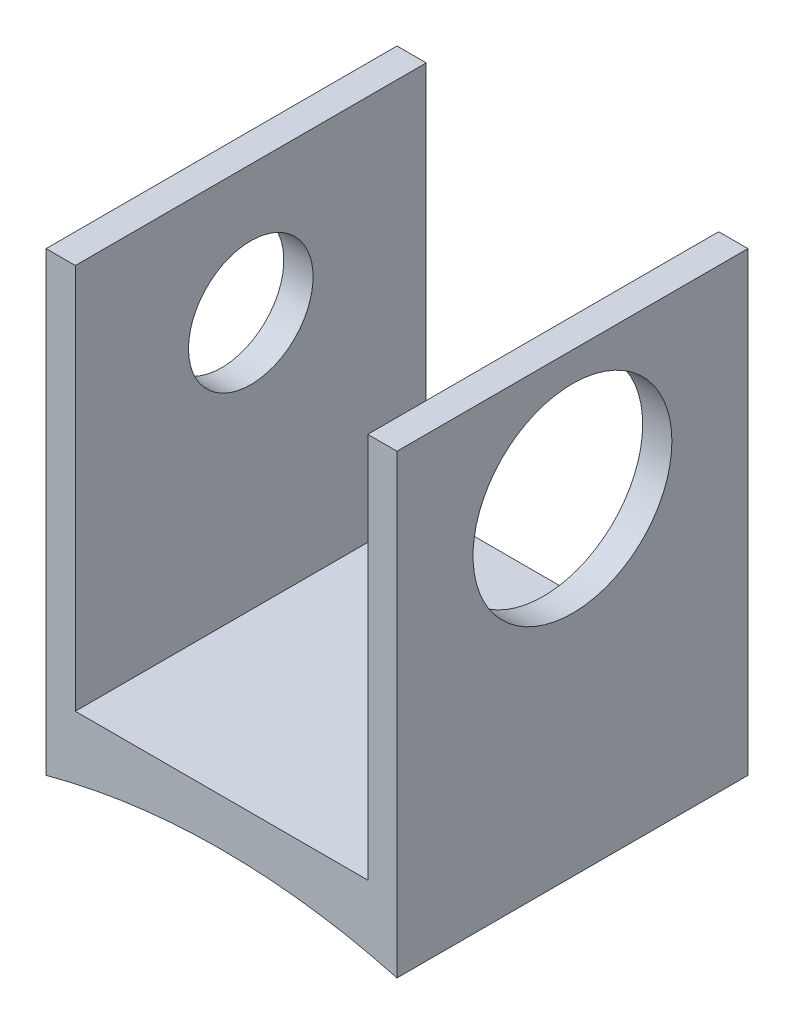
ISO-10303-21;
HEADER;
FILE_DESCRIPTION(('STEP AP214'),'2;1');
FILE_NAME('part.step','',(''),(''),'','','');
FILE_SCHEMA(('AUTOMOTIVE_DESIGN { 1 0 10303 214 1 1 1 1 }'));
ENDSEC;
DATA;
#1=APPLICATION_CONTEXT('core data for automotive mechanical design processes');
#2=APPLICATION_PROTOCOL_DEFINITION('international standard','automotive_design',2000,#1);
#3=PRODUCT_CONTEXT('',#1,'mechanical');
#4=PRODUCT('Part','Part','',(#3));
#5=PRODUCT_RELATED_PRODUCT_CATEGORY('part','',(#4));
#6=PRODUCT_DEFINITION_FORMATION('','',#4);
#7=PRODUCT_DEFINITION_CONTEXT('part definition',#1,'design');
#8=PRODUCT_DEFINITION('design','',#6,#7);
#9=PRODUCT_DEFINITION_SHAPE('','',#8);
#10=(LENGTH_UNIT() NAMED_UNIT(*) SI_UNIT(.MILLI.,.METRE.));
#11=(NAMED_UNIT(*) PLANE_ANGLE_UNIT() SI_UNIT($,.RADIAN.));
#12=(NAMED_UNIT(*) SI_UNIT($,.STERADIAN.) SOLID_ANGLE_UNIT());
#13=UNCERTAINTY_MEASURE_WITH_UNIT(LENGTH_MEASURE(1.E-05),#10,'distance_accuracy_value','');
#14=(GEOMETRIC_REPRESENTATION_CONTEXT(3) GLOBAL_UNCERTAINTY_ASSIGNED_CONTEXT((#13)) GLOBAL_UNIT_ASSIGNED_CONTEXT((#10,
#11,#12)) REPRESENTATION_CONTEXT('',''));
#15=CARTESIAN_POINT('',(0.,0.,0.));
#16=DIRECTION('',(0.,0.,1.));
#17=DIRECTION('',(1.,0.,0.));
#18=AXIS2_PLACEMENT_3D('',#15,#16,#17);
#19=CARTESIAN_POINT('',(-2.71887323943662,7.61418661971831,7.62));
#20=DIRECTION('',(0.,-1.,0.));
#21=DIRECTION('',(0.,0.,-1.));
#22=AXIS2_PLACEMENT_3D('',#19,#20,#21);
#23=PLANE('',#22);
#24=DIRECTION('',(-1.,0.,0.));
#25=VECTOR('',#24,1.);
#26=CARTESIAN_POINT('',(-2.71887323943662,7.61418661971831,0.));
#27=LINE('',#26,#25);
#28=CARTESIAN_POINT('',(-2.71887323943662,7.61418661971831,0.));
#29=VERTEX_POINT('',#28);
#30=CARTESIAN_POINT('',(-3.35387323943662,7.61418661971831,0.));
#31=VERTEX_POINT('',#30);
#32=EDGE_CURVE('E129',#29,#31,#27,.T.);
#33=ORIENTED_EDGE('',*,*,#32,.T.);
#34=DIRECTION('',(0.,0.,-1.));
#35=VECTOR('',#34,1.);
#36=CARTESIAN_POINT('',(-3.35387323943662,7.61418661971831,7.62));
#37=LINE('',#36,#35);
#38=CARTESIAN_POINT('',(-3.35387323943662,7.61418661971831,7.62));
#39=VERTEX_POINT('',#38);
#40=EDGE_CURVE('E11',#39,#31,#37,.T.);
#41=ORIENTED_EDGE('',*,*,#40,.F.);
#42=DIRECTION('',(-1.,0.,0.));
#43=VECTOR('',#42,1.);
#44=CARTESIAN_POINT('',(-2.71887323943662,7.61418661971831,7.62));
#45=LINE('',#44,#43);
#46=CARTESIAN_POINT('',(-2.71887323943662,7.61418661971831,7.62));
#47=VERTEX_POINT('',#46);
#48=EDGE_CURVE('E143',#47,#39,#45,.T.);
#49=ORIENTED_EDGE('',*,*,#48,.F.);
#50=DIRECTION('',(0.,0.,-1.));
#51=VECTOR('',#50,1.);
#52=CARTESIAN_POINT('',(-2.71887323943662,7.61418661971831,7.62));
#53=LINE('',#52,#51);
#54=EDGE_CURVE('E125',#47,#29,#53,.T.);
#55=ORIENTED_EDGE('',*,*,#54,.T.);
#56=EDGE_LOOP('',(#33,#41,#49,#55));
#57=FACE_BOUND('',#56,.T.);
#58=ADVANCED_FACE('F36',(#57),#23,.F.);
#59=CARTESIAN_POINT('',(-3.35387323943662,7.61418661971831,7.62));
#60=DIRECTION('',(1.,0.,0.));
#61=DIRECTION('',(0.,1.,0.));
#62=AXIS2_PLACEMENT_3D('',#59,#60,#61);
#63=PLANE('',#62);
#64=CARTESIAN_POINT('',(-3.35387323943662,4.82018661971831,3.81));
#65=DIRECTION('',(-1.,0.,0.));
#66=DIRECTION('',(0.,0.,1.));
#67=AXIS2_PLACEMENT_3D('',#64,#65,#66);
#68=CIRCLE('',#67,1.35254999999999);
#69=CARTESIAN_POINT('',(-3.35387323943662,4.82018661971831,5.16254999999999));
#70=VERTEX_POINT('',#69);
#71=EDGE_CURVE('E187',#70,#70,#68,.T.);
#72=ORIENTED_EDGE('',*,*,#71,.F.);
#73=EDGE_LOOP('',(#72));
#74=FACE_BOUND('',#73,.T.);
#75=DIRECTION('',(0.,-1.,0.));
#76=VECTOR('',#75,1.);
#77=CARTESIAN_POINT('',(-3.35387323943662,7.61418661971831,0.));
#78=LINE('',#77,#76);
#79=CARTESIAN_POINT('',(-3.35387323943662,-2.29181338028169,0.));
#80=VERTEX_POINT('',#79);
#81=EDGE_CURVE('E132',#31,#80,#78,.T.);
#82=ORIENTED_EDGE('',*,*,#81,.T.);
#83=DIRECTION('',(0.,0.,-1.));
#84=VECTOR('',#83,1.);
#85=CARTESIAN_POINT('',(-3.35387323943662,-2.29181338028169,7.62));
#86=LINE('',#85,#84);
#87=CARTESIAN_POINT('',(-3.35387323943662,-2.29181338028169,7.62));
#88=VERTEX_POINT('',#87);
#89=EDGE_CURVE('E44',#88,#80,#86,.T.);
#90=ORIENTED_EDGE('',*,*,#89,.F.);
#91=DIRECTION('',(0.,-1.,0.));
#92=VECTOR('',#91,1.);
#93=CARTESIAN_POINT('',(-3.35387323943662,7.61418661971831,7.62));
#94=LINE('',#93,#92);
#95=EDGE_CURVE('E93',#39,#88,#94,.T.);
#96=ORIENTED_EDGE('',*,*,#95,.F.);
#97=ORIENTED_EDGE('',*,*,#40,.T.);
#98=EDGE_LOOP('',(#82,#90,#96,#97));
#99=FACE_BOUND('',#98,.T.);
#100=ADVANCED_FACE('F166',(#74,#99),#63,.F.);
#101=CARTESIAN_POINT('',(4.26612676056338,-2.29181338028169,7.62));
#102=DIRECTION('',(-1.,0.,0.));
#103=DIRECTION('',(0.,-1.,0.));
#104=AXIS2_PLACEMENT_3D('',#101,#102,#103);
#105=PLANE('',#104);
#106=CARTESIAN_POINT('',(4.26612676056338,4.82018661971831,3.81));
#107=DIRECTION('',(1.,0.,0.));
#108=DIRECTION('',(0.,0.,-1.));
#109=AXIS2_PLACEMENT_3D('',#106,#107,#108);
#110=CIRCLE('',#109,2.159);
#111=CARTESIAN_POINT('',(4.26612676056338,4.82018661971831,1.651));
#112=VERTEX_POINT('',#111);
#113=EDGE_CURVE('E182',#112,#112,#110,.T.);
#114=ORIENTED_EDGE('',*,*,#113,.F.);
#115=EDGE_LOOP('',(#114));
#116=FACE_BOUND('',#115,.T.);
#117=DIRECTION('',(0.,1.,0.));
#118=VECTOR('',#117,1.);
#119=CARTESIAN_POINT('',(4.26612676056338,-2.29181338028169,0.));
#120=LINE('',#119,#118);
#121=CARTESIAN_POINT('',(4.26612676056338,-2.29181338028169,0.));
#122=VERTEX_POINT('',#121);
#123=CARTESIAN_POINT('',(4.26612676056338,7.61418661971831,0.));
#124=VERTEX_POINT('',#123);
#125=EDGE_CURVE('E136',#122,#124,#120,.T.);
#126=ORIENTED_EDGE('',*,*,#125,.T.);
#127=DIRECTION('',(0.,0.,-1.));
#128=VECTOR('',#127,1.);
#129=CARTESIAN_POINT('',(4.26612676056338,7.61418661971831,7.62));
#130=LINE('',#129,#128);
#131=CARTESIAN_POINT('',(4.26612676056338,7.61418661971831,7.62));
#132=VERTEX_POINT('',#131);
#133=EDGE_CURVE('E147',#132,#124,#130,.T.);
#134=ORIENTED_EDGE('',*,*,#133,.F.);
#135=DIRECTION('',(0.,1.,0.));
#136=VECTOR('',#135,1.);
#137=CARTESIAN_POINT('',(4.26612676056338,-2.29181338028169,7.62));
#138=LINE('',#137,#136);
#139=CARTESIAN_POINT('',(4.26612676056338,-2.29181338028169,7.62));
#140=VERTEX_POINT('',#139);
#141=EDGE_CURVE('E177',#140,#132,#138,.T.);
#142=ORIENTED_EDGE('',*,*,#141,.F.);
#143=DIRECTION('',(0.,0.,-1.));
#144=VECTOR('',#143,1.);
#145=CARTESIAN_POINT('',(4.26612676056338,-2.29181338028169,7.62));
#146=LINE('',#145,#144);
#147=EDGE_CURVE('E150',#140,#122,#146,.T.);
#148=ORIENTED_EDGE('',*,*,#147,.T.);
#149=EDGE_LOOP('',(#126,#134,#142,#148));
#150=FACE_BOUND('',#149,.T.);
#151=ADVANCED_FACE('F175',(#116,#150),#105,.F.);
#152=CARTESIAN_POINT('',(3.63112676056338,7.61418661971831,7.62));
#153=DIRECTION('',(0.,-1.,0.));
#154=DIRECTION('',(0.,0.,-1.));
#155=AXIS2_PLACEMENT_3D('',#152,#153,#154);
#156=PLANE('',#155);
#157=DIRECTION('',(-1.,0.,0.));
#158=VECTOR('',#157,1.);
#159=CARTESIAN_POINT('',(3.63112676056338,7.61418661971831,0.));
#160=LINE('',#159,#158);
#161=CARTESIAN_POINT('',(3.63112676056338,7.61418661971831,0.));
#162=VERTEX_POINT('',#161);
#163=EDGE_CURVE('E138',#124,#162,#160,.T.);
#164=ORIENTED_EDGE('',*,*,#163,.T.);
#165=DIRECTION('',(0.,0.,-1.));
#166=VECTOR('',#165,1.);
#167=CARTESIAN_POINT('',(3.63112676056338,7.61418661971831,7.62));
#168=LINE('',#167,#166);
#169=CARTESIAN_POINT('',(3.63112676056338,7.61418661971831,7.62));
#170=VERTEX_POINT('',#169);
#171=EDGE_CURVE('E120',#170,#162,#168,.T.);
#172=ORIENTED_EDGE('',*,*,#171,.F.);
#173=DIRECTION('',(-1.,0.,0.));
#174=VECTOR('',#173,1.);
#175=CARTESIAN_POINT('',(3.63112676056338,7.61418661971831,7.62));
#176=LINE('',#175,#174);
#177=EDGE_CURVE('E111',#132,#170,#176,.T.);
#178=ORIENTED_EDGE('',*,*,#177,.F.);
#179=ORIENTED_EDGE('',*,*,#133,.T.);
#180=EDGE_LOOP('',(#164,#172,#178,#179));
#181=FACE_BOUND('',#180,.T.);
#182=ADVANCED_FACE('F171',(#181),#156,.F.);
#183=CARTESIAN_POINT('',(3.63112676056338,7.61418661971831,7.62));
#184=DIRECTION('',(1.,0.,0.));
#185=DIRECTION('',(0.,1.,0.));
#186=AXIS2_PLACEMENT_3D('',#183,#184,#185);
#187=PLANE('',#186);
#188=CARTESIAN_POINT('',(3.63112676056338,4.82018661971831,3.81));
#189=DIRECTION('',(1.,0.,0.));
#190=DIRECTION('',(0.,1.,0.));
#191=AXIS2_PLACEMENT_3D('',#188,#189,#190);
#192=CIRCLE('',#191,2.159);
#193=CARTESIAN_POINT('',(3.63112676056338,6.97918661971831,3.81));
#194=VERTEX_POINT('',#193);
#195=EDGE_CURVE('E179',#194,#194,#192,.F.);
#196=ORIENTED_EDGE('',*,*,#195,.F.);
#197=EDGE_LOOP('',(#196));
#198=FACE_BOUND('',#197,.T.);
#199=DIRECTION('',(0.,-1.,0.));
#200=VECTOR('',#199,1.);
#201=CARTESIAN_POINT('',(3.63112676056338,7.61418661971831,0.));
#202=LINE('',#201,#200);
#203=CARTESIAN_POINT('',(3.63112676056338,-0.767813380281691,0.));
#204=VERTEX_POINT('',#203);
#205=EDGE_CURVE('E119',#162,#204,#202,.T.);
#206=ORIENTED_EDGE('',*,*,#205,.T.);
#207=DIRECTION('',(0.,0.,-1.));
#208=VECTOR('',#207,1.);
#209=CARTESIAN_POINT('',(3.63112676056338,-0.767813380281691,7.62));
#210=LINE('',#209,#208);
#211=CARTESIAN_POINT('',(3.63112676056338,-0.767813380281691,7.62));
#212=VERTEX_POINT('',#211);
#213=EDGE_CURVE('E116',#212,#204,#210,.T.);
#214=ORIENTED_EDGE('',*,*,#213,.F.);
#215=DIRECTION('',(0.,-1.,0.));
#216=VECTOR('',#215,1.);
#217=CARTESIAN_POINT('',(3.63112676056338,7.61418661971831,7.62));
#218=LINE('',#217,#216);
#219=EDGE_CURVE('E104',#170,#212,#218,.T.);
#220=ORIENTED_EDGE('',*,*,#219,.F.);
#221=ORIENTED_EDGE('',*,*,#171,.T.);
#222=EDGE_LOOP('',(#206,#214,#220,#221));
#223=FACE_BOUND('',#222,.T.);
#224=ADVANCED_FACE('F117',(#198,#223),#187,.F.);
#225=CARTESIAN_POINT('',(3.63112676056338,-0.767813380281691,7.62));
#226=DIRECTION('',(0.,-1.,0.));
#227=DIRECTION('',(1.,0.,0.));
#228=AXIS2_PLACEMENT_3D('',#225,#226,#227);
#229=PLANE('',#228);
#230=DIRECTION('',(-1.,0.,0.));
#231=VECTOR('',#230,1.);
#232=CARTESIAN_POINT('',(3.63112676056338,-0.767813380281691,0.));
#233=LINE('',#232,#231);
#234=CARTESIAN_POINT('',(-2.71887323943662,-0.767813380281691,0.));
#235=VERTEX_POINT('',#234);
#236=EDGE_CURVE('E79',#204,#235,#233,.T.);
#237=ORIENTED_EDGE('',*,*,#236,.T.);
#238=DIRECTION('',(0.,0.,-1.));
#239=VECTOR('',#238,1.);
#240=CARTESIAN_POINT('',(-2.71887323943662,-0.767813380281691,7.62));
#241=LINE('',#240,#239);
#242=CARTESIAN_POINT('',(-2.71887323943662,-0.767813380281691,7.62));
#243=VERTEX_POINT('',#242);
#244=EDGE_CURVE('E121',#243,#235,#241,.T.);
#245=ORIENTED_EDGE('',*,*,#244,.F.);
#246=DIRECTION('',(-1.,0.,0.));
#247=VECTOR('',#246,1.);
#248=CARTESIAN_POINT('',(3.63112676056338,-0.767813380281691,7.62));
#249=LINE('',#248,#247);
#250=EDGE_CURVE('E109',#212,#243,#249,.T.);
#251=ORIENTED_EDGE('',*,*,#250,.F.);
#252=ORIENTED_EDGE('',*,*,#213,.T.);
#253=EDGE_LOOP('',(#237,#245,#251,#252));
#254=FACE_BOUND('',#253,.T.);
#255=ADVANCED_FACE('F123',(#254),#229,.F.);
#256=CARTESIAN_POINT('',(-2.71887323943662,-0.767813380281691,7.62));
#257=DIRECTION('',(-1.,0.,0.));
#258=DIRECTION('',(0.,0.,1.));
#259=AXIS2_PLACEMENT_3D('',#256,#257,#258);
#260=PLANE('',#259);
#261=CARTESIAN_POINT('',(-2.71887323943662,4.82018661971831,3.81));
#262=DIRECTION('',(-1.,0.,0.));
#263=DIRECTION('',(0.,0.,1.));
#264=AXIS2_PLACEMENT_3D('',#261,#262,#263);
#265=CIRCLE('',#264,1.35254999999999);
#266=CARTESIAN_POINT('',(-2.71887323943662,4.82018661971831,5.16254999999999));
#267=VERTEX_POINT('',#266);
#268=EDGE_CURVE('E133',#267,#267,#265,.T.);
#269=ORIENTED_EDGE('',*,*,#268,.T.);
#270=EDGE_LOOP('',(#269));
#271=FACE_BOUND('',#270,.T.);
#272=DIRECTION('',(0.,1.,0.));
#273=VECTOR('',#272,1.);
#274=CARTESIAN_POINT('',(-2.71887323943662,-0.767813380281691,0.));
#275=LINE('',#274,#273);
#276=EDGE_CURVE('E85',#235,#29,#275,.T.);
#277=ORIENTED_EDGE('',*,*,#276,.T.);
#278=ORIENTED_EDGE('',*,*,#54,.F.);
#279=DIRECTION('',(0.,1.,0.));
#280=VECTOR('',#279,1.);
#281=CARTESIAN_POINT('',(-2.71887323943662,-0.767813380281691,7.62));
#282=LINE('',#281,#280);
#283=EDGE_CURVE('E52',#243,#47,#282,.T.);
#284=ORIENTED_EDGE('',*,*,#283,.F.);
#285=ORIENTED_EDGE('',*,*,#244,.T.);
#286=EDGE_LOOP('',(#277,#278,#284,#285));
#287=FACE_BOUND('',#286,.T.);
#288=ADVANCED_FACE('F196',(#271,#287),#260,.F.);
#289=CARTESIAN_POINT('',(0.,0.,7.62));
#290=DIRECTION('',(0.,0.,1.));
#291=DIRECTION('',(1.,0.,0.));
#292=AXIS2_PLACEMENT_3D('',#289,#290,#291);
#293=PLANE('',#292);
#294=CARTESIAN_POINT('',(0.456126760563381,-16.2595040985071,7.62));
#295=DIRECTION('',(0.,0.,-1.));
#296=DIRECTION('',(1.,0.,0.));
#297=AXIS2_PLACEMENT_3D('',#294,#295,#296);
#298=CIRCLE('',#297,14.478);
#299=EDGE_CURVE('E159',#88,#140,#298,.T.);
#300=ORIENTED_EDGE('',*,*,#299,.T.);
#301=ORIENTED_EDGE('',*,*,#141,.T.);
#302=ORIENTED_EDGE('',*,*,#177,.T.);
#303=ORIENTED_EDGE('',*,*,#219,.T.);
#304=ORIENTED_EDGE('',*,*,#250,.T.);
#305=ORIENTED_EDGE('',*,*,#283,.T.);
#306=ORIENTED_EDGE('',*,*,#48,.T.);
#307=ORIENTED_EDGE('',*,*,#95,.T.);
#308=EDGE_LOOP('',(#300,#301,#302,#303,#304,#305,#306,#307));
#309=FACE_BOUND('',#308,.T.);
#310=ADVANCED_FACE('F107',(#309),#293,.T.);
#311=CARTESIAN_POINT('',(0.,0.,0.));
#312=DIRECTION('',(0.,0.,1.));
#313=DIRECTION('',(1.,0.,0.));
#314=AXIS2_PLACEMENT_3D('',#311,#312,#313);
#315=PLANE('',#314);
#316=ORIENTED_EDGE('',*,*,#125,.F.);
#317=CARTESIAN_POINT('',(0.456126760563381,-16.2595040985071,0.));
#318=DIRECTION('',(0.,0.,-1.));
#319=DIRECTION('',(1.,0.,0.));
#320=AXIS2_PLACEMENT_3D('',#317,#318,#319);
#321=CIRCLE('',#320,14.478);
#322=EDGE_CURVE('E158',#80,#122,#321,.T.);
#323=ORIENTED_EDGE('',*,*,#322,.F.);
#324=ORIENTED_EDGE('',*,*,#81,.F.);
#325=ORIENTED_EDGE('',*,*,#32,.F.);
#326=ORIENTED_EDGE('',*,*,#276,.F.);
#327=ORIENTED_EDGE('',*,*,#236,.F.);
#328=ORIENTED_EDGE('',*,*,#205,.F.);
#329=ORIENTED_EDGE('',*,*,#163,.F.);
#330=EDGE_LOOP('',(#316,#323,#324,#325,#326,#327,#328,#329));
#331=FACE_BOUND('',#330,.T.);
#332=ADVANCED_FACE('F162',(#331),#315,.F.);
#333=CARTESIAN_POINT('',(-3.35387323943662,4.82018661971831,3.81));
#334=DIRECTION('',(-1.,0.,0.));
#335=DIRECTION('',(0.,0.,1.));
#336=AXIS2_PLACEMENT_3D('',#333,#334,#335);
#337=CYLINDRICAL_SURFACE('',#336,1.35254999999999);
#338=ORIENTED_EDGE('',*,*,#268,.F.);
#339=EDGE_LOOP('',(#338));
#340=FACE_BOUND('',#339,.T.);
#341=ORIENTED_EDGE('',*,*,#71,.T.);
#342=EDGE_LOOP('',(#341));
#343=FACE_BOUND('',#342,.T.);
#344=ADVANCED_FACE('F198',(#340,#343),#337,.F.);
#345=CARTESIAN_POINT('',(-3.35487323943662,4.82018661971831,3.81));
#346=DIRECTION('',(1.,0.,0.));
#347=DIRECTION('',(0.,0.,-1.));
#348=AXIS2_PLACEMENT_3D('',#345,#346,#347);
#349=CYLINDRICAL_SURFACE('',#348,2.159);
#350=ORIENTED_EDGE('',*,*,#113,.T.);
#351=EDGE_LOOP('',(#350));
#352=FACE_BOUND('',#351,.T.);
#353=ORIENTED_EDGE('',*,*,#195,.T.);
#354=EDGE_LOOP('',(#353));
#355=FACE_BOUND('',#354,.T.);
#356=ADVANCED_FACE('F201',(#352,#355),#349,.F.);
#357=CARTESIAN_POINT('',(0.456126760563381,-16.2595040985071,7.62));
#358=DIRECTION('',(0.,0.,-1.));
#359=DIRECTION('',(-1.,0.,0.));
#360=AXIS2_PLACEMENT_3D('',#357,#358,#359);
#361=CYLINDRICAL_SURFACE('',#360,14.478);
#362=ORIENTED_EDGE('',*,*,#322,.T.);
#363=ORIENTED_EDGE('',*,*,#147,.F.);
#364=ORIENTED_EDGE('',*,*,#299,.F.);
#365=ORIENTED_EDGE('',*,*,#89,.T.);
#366=EDGE_LOOP('',(#362,#363,#364,#365));
#367=FACE_BOUND('',#366,.T.);
#368=ADVANCED_FACE('F156',(#367),#361,.F.);
#369=CLOSED_SHELL('',(#58,#100,#151,#182,#224,#255,#288,#310,#332,#344,#356,#368));
#370=MANIFOLD_SOLID_BREP('B2',#369);
#371=ADVANCED_BREP_SHAPE_REPRESENTATION('',(#18,#370),#14);
#372=SHAPE_DEFINITION_REPRESENTATION(#9,#371);
ENDSEC;
END-ISO-10303-21;
